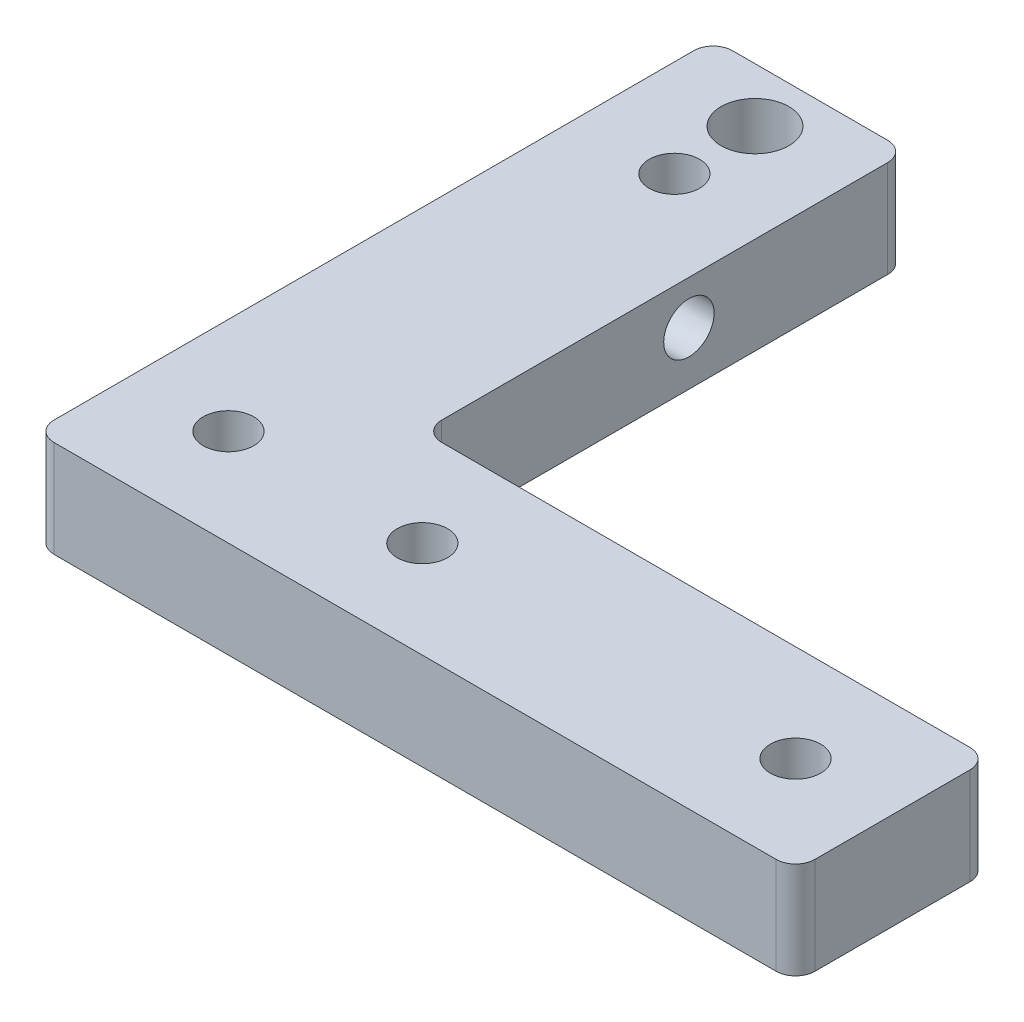
ISO-10303-21;
HEADER;
FILE_DESCRIPTION(('STEP AP214'),'2;1');
FILE_NAME('part.step','',(''),(''),'','','');
FILE_SCHEMA(('AUTOMOTIVE_DESIGN { 1 0 10303 214 1 1 1 1 }'));
ENDSEC;
DATA;
#1=APPLICATION_CONTEXT('core data for automotive mechanical design processes');
#2=APPLICATION_PROTOCOL_DEFINITION('international standard','automotive_design',2000,#1);
#3=PRODUCT_CONTEXT('',#1,'mechanical');
#4=PRODUCT('Part','Part','',(#3));
#5=PRODUCT_RELATED_PRODUCT_CATEGORY('part','',(#4));
#6=PRODUCT_DEFINITION_FORMATION('','',#4);
#7=PRODUCT_DEFINITION_CONTEXT('part definition',#1,'design');
#8=PRODUCT_DEFINITION('design','',#6,#7);
#9=PRODUCT_DEFINITION_SHAPE('','',#8);
#10=(LENGTH_UNIT() NAMED_UNIT(*) SI_UNIT(.MILLI.,.METRE.));
#11=(NAMED_UNIT(*) PLANE_ANGLE_UNIT() SI_UNIT($,.RADIAN.));
#12=(NAMED_UNIT(*) SI_UNIT($,.STERADIAN.) SOLID_ANGLE_UNIT());
#13=UNCERTAINTY_MEASURE_WITH_UNIT(LENGTH_MEASURE(1.E-05),#10,'distance_accuracy_value','');
#14=(GEOMETRIC_REPRESENTATION_CONTEXT(3) GLOBAL_UNCERTAINTY_ASSIGNED_CONTEXT((#13)) GLOBAL_UNIT_ASSIGNED_CONTEXT((#10,
#11,#12)) REPRESENTATION_CONTEXT('',''));
#15=CARTESIAN_POINT('',(0.,0.,0.));
#16=DIRECTION('',(0.,0.,1.));
#17=DIRECTION('',(1.,0.,0.));
#18=AXIS2_PLACEMENT_3D('',#15,#16,#17);
#19=CARTESIAN_POINT('',(9.89945477,5.,-64.41665231));
#20=DIRECTION('',(0.,1.,0.));
#21=DIRECTION('',(-1.,0.,0.));
#22=AXIS2_PLACEMENT_3D('',#19,#20,#21);
#23=PLANE('',#22);
#24=CARTESIAN_POINT('',(9.89945477,5.,-64.41665231));
#25=DIRECTION('',(0.,1.,0.));
#26=DIRECTION('',(-1.,0.,0.));
#27=AXIS2_PLACEMENT_3D('',#24,#25,#26);
#28=CIRCLE('',#27,3.5);
#29=CARTESIAN_POINT('',(6.39945476999999,5.,-64.41665231));
#30=VERTEX_POINT('',#29);
#31=EDGE_CURVE('E19',#30,#30,#28,.T.);
#32=ORIENTED_EDGE('',*,*,#31,.T.);
#33=EDGE_LOOP('',(#32));
#34=FACE_BOUND('',#33,.T.);
#35=ADVANCED_FACE('F16',(#34),#23,.T.);
#36=CARTESIAN_POINT('',(9.89945477,5.,-64.41665231));
#37=DIRECTION('',(0.,1.,0.));
#38=DIRECTION('',(-1.,0.,0.));
#39=AXIS2_PLACEMENT_3D('',#36,#37,#38);
#40=CYLINDRICAL_SURFACE('',#39,3.5);
#41=CARTESIAN_POINT('',(9.89945477,10.,-64.41665231));
#42=DIRECTION('',(0.,1.,0.));
#43=DIRECTION('',(-1.,0.,0.));
#44=AXIS2_PLACEMENT_3D('',#41,#42,#43);
#45=CIRCLE('',#44,3.5);
#46=CARTESIAN_POINT('',(6.39945476999999,10.,-64.41665231));
#47=VERTEX_POINT('',#46);
#48=EDGE_CURVE('E140',#47,#47,#45,.F.);
#49=ORIENTED_EDGE('',*,*,#48,.F.);
#50=EDGE_LOOP('',(#49));
#51=FACE_BOUND('',#50,.T.);
#52=ORIENTED_EDGE('',*,*,#31,.F.);
#53=EDGE_LOOP('',(#52));
#54=FACE_BOUND('',#53,.T.);
#55=ADVANCED_FACE('F268',(#51,#54),#40,.F.);
#56=CARTESIAN_POINT('',(78.5,5.49999999999994,-47.5));
#57=DIRECTION('',(-1.,0.,0.));
#58=DIRECTION('',(0.,-1.,0.));
#59=AXIS2_PLACEMENT_3D('',#56,#57,#58);
#60=CYLINDRICAL_SURFACE('',#59,2.6);
#61=CARTESIAN_POINT('',(20.,5.49999999999995,-47.5));
#62=DIRECTION('',(-1.,0.,0.));
#63=DIRECTION('',(0.,-1.,0.));
#64=AXIS2_PLACEMENT_3D('',#61,#62,#63);
#65=CIRCLE('',#64,2.6);
#66=CARTESIAN_POINT('',(20.,2.89999999999995,-47.5));
#67=VERTEX_POINT('',#66);
#68=EDGE_CURVE('E254',#67,#67,#65,.F.);
#69=ORIENTED_EDGE('',*,*,#68,.T.);
#70=EDGE_LOOP('',(#69));
#71=FACE_BOUND('',#70,.T.);
#72=CARTESIAN_POINT('',(12.0000000000005,5.49999999999995,-47.5));
#73=DIRECTION('',(-1.,0.,0.));
#74=DIRECTION('',(0.,0.,1.));
#75=AXIS2_PLACEMENT_3D('',#72,#73,#74);
#76=CIRCLE('',#75,2.60000000000161);
#77=CARTESIAN_POINT('',(12.0000000000005,5.49999999999995,-44.8999999999984));
#78=VERTEX_POINT('',#77);
#79=EDGE_CURVE('E185',#78,#78,#76,.T.);
#80=ORIENTED_EDGE('',*,*,#79,.T.);
#81=EDGE_LOOP('',(#80));
#82=FACE_BOUND('',#81,.T.);
#83=ADVANCED_FACE('F271',(#71,#82),#60,.F.);
#84=CARTESIAN_POINT('',(1.70530098671652E-10,5.49999999999995,-47.5));
#85=DIRECTION('',(-1.,0.,0.));
#86=DIRECTION('',(0.,0.,1.));
#87=AXIS2_PLACEMENT_3D('',#84,#85,#86);
#88=CONICAL_SURFACE('',#87,3.6498639623025,0.087266462600045);
#89=CARTESIAN_POINT('',(0.,5.49999999999995,-47.5));
#90=DIRECTION('',(-1.,0.,0.));
#91=DIRECTION('',(0.,0.,1.));
#92=AXIS2_PLACEMENT_3D('',#89,#90,#91);
#93=CIRCLE('',#92,3.64986396231742);
#94=CARTESIAN_POINT('',(0.,5.49999999999995,-43.8501360376826));
#95=VERTEX_POINT('',#94);
#96=EDGE_CURVE('E245',#95,#95,#93,.T.);
#97=ORIENTED_EDGE('',*,*,#96,.T.);
#98=EDGE_LOOP('',(#97));
#99=FACE_BOUND('',#98,.T.);
#100=ORIENTED_EDGE('',*,*,#79,.F.);
#101=EDGE_LOOP('',(#100));
#102=FACE_BOUND('',#101,.T.);
#103=ADVANCED_FACE('F351',(#99,#102),#88,.F.);
#104=CARTESIAN_POINT('',(0.,10.,0.));
#105=DIRECTION('',(0.,1.,0.));
#106=DIRECTION('',(-1.,0.,0.));
#107=AXIS2_PLACEMENT_3D('',#104,#105,#106);
#108=PLANE('',#107);
#109=CARTESIAN_POINT('',(30.,10.,-10.));
#110=DIRECTION('',(0.,-1.,0.));
#111=DIRECTION('',(1.,0.,0.));
#112=AXIS2_PLACEMENT_3D('',#109,#110,#111);
#113=CIRCLE('',#112,2.59999999999999);
#114=CARTESIAN_POINT('',(32.6,10.,-10.));
#115=VERTEX_POINT('',#114);
#116=EDGE_CURVE('E227',#115,#115,#113,.T.);
#117=ORIENTED_EDGE('',*,*,#116,.T.);
#118=EDGE_LOOP('',(#117));
#119=FACE_BOUND('',#118,.T.);
#120=CARTESIAN_POINT('',(68.5,10.,-9.99999999999999));
#121=DIRECTION('',(0.,-1.,0.));
#122=DIRECTION('',(1.,0.,0.));
#123=AXIS2_PLACEMENT_3D('',#120,#121,#122);
#124=CIRCLE('',#123,2.59999999999999);
#125=CARTESIAN_POINT('',(71.1,10.,-9.99999999999999));
#126=VERTEX_POINT('',#125);
#127=EDGE_CURVE('E235',#126,#126,#124,.T.);
#128=ORIENTED_EDGE('',*,*,#127,.T.);
#129=EDGE_LOOP('',(#128));
#130=FACE_BOUND('',#129,.T.);
#131=DIRECTION('',(1.,0.,0.));
#132=VECTOR('',#131,1.);
#133=CARTESIAN_POINT('',(20.,10.,-70.));
#134=LINE('',#133,#132);
#135=CARTESIAN_POINT('',(18.,10.,-70.));
#136=VERTEX_POINT('',#135);
#137=CARTESIAN_POINT('',(2.,10.,-70.));
#138=VERTEX_POINT('',#137);
#139=EDGE_CURVE('E169',#136,#138,#134,.F.);
#140=ORIENTED_EDGE('',*,*,#139,.T.);
#141=CARTESIAN_POINT('',(2.,10.,-68.));
#142=DIRECTION('',(0.,-1.,0.));
#143=DIRECTION('',(1.,0.,0.));
#144=AXIS2_PLACEMENT_3D('',#141,#142,#143);
#145=CIRCLE('',#144,2.);
#146=CARTESIAN_POINT('',(0.,10.,-68.));
#147=VERTEX_POINT('',#146);
#148=EDGE_CURVE('E172',#147,#138,#145,.T.);
#149=ORIENTED_EDGE('',*,*,#148,.F.);
#150=DIRECTION('',(0.,0.,1.));
#151=VECTOR('',#150,1.);
#152=CARTESIAN_POINT('',(0.,10.,-70.));
#153=LINE('',#152,#151);
#154=CARTESIAN_POINT('',(0.,10.,-2.));
#155=VERTEX_POINT('',#154);
#156=EDGE_CURVE('E163',#147,#155,#153,.T.);
#157=ORIENTED_EDGE('',*,*,#156,.T.);
#158=CARTESIAN_POINT('',(2.,10.,-2.));
#159=DIRECTION('',(0.,-1.,0.));
#160=DIRECTION('',(1.,0.,0.));
#161=AXIS2_PLACEMENT_3D('',#158,#159,#160);
#162=CIRCLE('',#161,2.);
#163=CARTESIAN_POINT('',(2.,10.,0.));
#164=VERTEX_POINT('',#163);
#165=EDGE_CURVE('E167',#164,#155,#162,.T.);
#166=ORIENTED_EDGE('',*,*,#165,.F.);
#167=DIRECTION('',(1.,0.,0.));
#168=VECTOR('',#167,1.);
#169=CARTESIAN_POINT('',(0.,10.,0.));
#170=LINE('',#169,#168);
#171=CARTESIAN_POINT('',(76.5,10.,0.));
#172=VERTEX_POINT('',#171);
#173=EDGE_CURVE('E133',#164,#172,#170,.T.);
#174=ORIENTED_EDGE('',*,*,#173,.T.);
#175=CARTESIAN_POINT('',(76.5,10.,-2.));
#176=DIRECTION('',(0.,-1.,0.));
#177=DIRECTION('',(1.,0.,0.));
#178=AXIS2_PLACEMENT_3D('',#175,#176,#177);
#179=CIRCLE('',#178,2.);
#180=CARTESIAN_POINT('',(78.5,10.,-2.));
#181=VERTEX_POINT('',#180);
#182=EDGE_CURVE('E126',#181,#172,#179,.T.);
#183=ORIENTED_EDGE('',*,*,#182,.F.);
#184=DIRECTION('',(0.,0.,1.));
#185=VECTOR('',#184,1.);
#186=CARTESIAN_POINT('',(78.5,10.,0.));
#187=LINE('',#186,#185);
#188=CARTESIAN_POINT('',(78.5,10.,-18.));
#189=VERTEX_POINT('',#188);
#190=EDGE_CURVE('E131',#181,#189,#187,.F.);
#191=ORIENTED_EDGE('',*,*,#190,.T.);
#192=CARTESIAN_POINT('',(76.5,10.,-18.));
#193=DIRECTION('',(0.,-1.,0.));
#194=DIRECTION('',(1.,0.,0.));
#195=AXIS2_PLACEMENT_3D('',#192,#193,#194);
#196=CIRCLE('',#195,2.);
#197=CARTESIAN_POINT('',(76.5,10.,-20.));
#198=VERTEX_POINT('',#197);
#199=EDGE_CURVE('E148',#198,#189,#196,.T.);
#200=ORIENTED_EDGE('',*,*,#199,.F.);
#201=DIRECTION('',(1.,0.,0.));
#202=VECTOR('',#201,1.);
#203=CARTESIAN_POINT('',(78.5,10.,-20.));
#204=LINE('',#203,#202);
#205=CARTESIAN_POINT('',(22.,10.,-20.));
#206=VERTEX_POINT('',#205);
#207=EDGE_CURVE('E180',#198,#206,#204,.F.);
#208=ORIENTED_EDGE('',*,*,#207,.T.);
#209=CARTESIAN_POINT('',(22.,10.,-22.));
#210=DIRECTION('',(0.,1.,0.));
#211=DIRECTION('',(-1.,0.,0.));
#212=AXIS2_PLACEMENT_3D('',#209,#210,#211);
#213=CIRCLE('',#212,2.);
#214=CARTESIAN_POINT('',(20.,10.,-22.));
#215=VERTEX_POINT('',#214);
#216=EDGE_CURVE('E258',#206,#215,#213,.F.);
#217=ORIENTED_EDGE('',*,*,#216,.T.);
#218=DIRECTION('',(0.,0.,1.));
#219=VECTOR('',#218,1.);
#220=CARTESIAN_POINT('',(20.,10.,-20.));
#221=LINE('',#220,#219);
#222=CARTESIAN_POINT('',(20.,10.,-68.));
#223=VERTEX_POINT('',#222);
#224=EDGE_CURVE('E174',#215,#223,#221,.F.);
#225=ORIENTED_EDGE('',*,*,#224,.T.);
#226=CARTESIAN_POINT('',(18.,10.,-68.));
#227=DIRECTION('',(0.,-1.,0.));
#228=DIRECTION('',(1.,0.,0.));
#229=AXIS2_PLACEMENT_3D('',#226,#227,#228);
#230=CIRCLE('',#229,2.);
#231=EDGE_CURVE('E178',#136,#223,#230,.T.);
#232=ORIENTED_EDGE('',*,*,#231,.F.);
#233=EDGE_LOOP('',(#140,#149,#157,#166,#174,#183,#191,#200,#208,#217,#225,#232));
#234=FACE_BOUND('',#233,.T.);
#235=CARTESIAN_POINT('',(10.,10.,-56.));
#236=DIRECTION('',(0.,-1.,0.));
#237=DIRECTION('',(1.,0.,0.));
#238=AXIS2_PLACEMENT_3D('',#235,#236,#237);
#239=CIRCLE('',#238,2.6);
#240=CARTESIAN_POINT('',(12.6,10.,-56.));
#241=VERTEX_POINT('',#240);
#242=EDGE_CURVE('E162',#241,#241,#239,.T.);
#243=ORIENTED_EDGE('',*,*,#242,.T.);
#244=EDGE_LOOP('',(#243));
#245=FACE_BOUND('',#244,.T.);
#246=CARTESIAN_POINT('',(10.,10.,-10.));
#247=DIRECTION('',(0.,-1.,0.));
#248=DIRECTION('',(1.,0.,0.));
#249=AXIS2_PLACEMENT_3D('',#246,#247,#248);
#250=CIRCLE('',#249,2.6);
#251=CARTESIAN_POINT('',(12.6,10.,-10.));
#252=VERTEX_POINT('',#251);
#253=EDGE_CURVE('E231',#252,#252,#250,.T.);
#254=ORIENTED_EDGE('',*,*,#253,.T.);
#255=EDGE_LOOP('',(#254));
#256=FACE_BOUND('',#255,.T.);
#257=ORIENTED_EDGE('',*,*,#48,.T.);
#258=EDGE_LOOP('',(#257));
#259=FACE_BOUND('',#258,.T.);
#260=ADVANCED_FACE('F129',(#119,#130,#234,#245,#256,#259),#108,.T.);
#261=CARTESIAN_POINT('',(76.5,10.,-2.));
#262=DIRECTION('',(0.,-1.,0.));
#263=DIRECTION('',(1.,0.,0.));
#264=AXIS2_PLACEMENT_3D('',#261,#262,#263);
#265=CYLINDRICAL_SURFACE('',#264,2.);
#266=CARTESIAN_POINT('',(76.5,0.,-2.));
#267=DIRECTION('',(0.,-1.,0.));
#268=DIRECTION('',(1.,0.,0.));
#269=AXIS2_PLACEMENT_3D('',#266,#267,#268);
#270=CIRCLE('',#269,2.);
#271=CARTESIAN_POINT('',(76.5,0.,0.));
#272=VERTEX_POINT('',#271);
#273=CARTESIAN_POINT('',(78.5,0.,-2.));
#274=VERTEX_POINT('',#273);
#275=EDGE_CURVE('E152',#272,#274,#270,.F.);
#276=ORIENTED_EDGE('',*,*,#275,.T.);
#277=DIRECTION('',(0.,-1.,0.));
#278=VECTOR('',#277,1.);
#279=CARTESIAN_POINT('',(78.5,10.,-2.));
#280=LINE('',#279,#278);
#281=EDGE_CURVE('E139',#274,#181,#280,.F.);
#282=ORIENTED_EDGE('',*,*,#281,.T.);
#283=ORIENTED_EDGE('',*,*,#182,.T.);
#284=DIRECTION('',(0.,1.,0.));
#285=VECTOR('',#284,1.);
#286=CARTESIAN_POINT('',(76.5,10.,0.));
#287=LINE('',#286,#285);
#288=EDGE_CURVE('E530',#172,#272,#287,.F.);
#289=ORIENTED_EDGE('',*,*,#288,.T.);
#290=EDGE_LOOP('',(#276,#282,#283,#289));
#291=FACE_BOUND('',#290,.T.);
#292=ADVANCED_FACE('F151',(#291),#265,.T.);
#293=CARTESIAN_POINT('',(78.5,10.,0.));
#294=DIRECTION('',(-1.,0.,0.));
#295=DIRECTION('',(0.,-1.,0.));
#296=AXIS2_PLACEMENT_3D('',#293,#294,#295);
#297=PLANE('',#296);
#298=ORIENTED_EDGE('',*,*,#281,.F.);
#299=DIRECTION('',(0.,0.,1.));
#300=VECTOR('',#299,1.);
#301=CARTESIAN_POINT('',(78.5,0.,0.));
#302=LINE('',#301,#300);
#303=CARTESIAN_POINT('',(78.5,0.,-18.));
#304=VERTEX_POINT('',#303);
#305=EDGE_CURVE('E224',#274,#304,#302,.F.);
#306=ORIENTED_EDGE('',*,*,#305,.T.);
#307=DIRECTION('',(0.,-1.,0.));
#308=VECTOR('',#307,1.);
#309=CARTESIAN_POINT('',(78.5,10.,-18.));
#310=LINE('',#309,#308);
#311=EDGE_CURVE('E146',#189,#304,#310,.T.);
#312=ORIENTED_EDGE('',*,*,#311,.F.);
#313=ORIENTED_EDGE('',*,*,#190,.F.);
#314=EDGE_LOOP('',(#298,#306,#312,#313));
#315=FACE_BOUND('',#314,.T.);
#316=ADVANCED_FACE('F143',(#315),#297,.F.);
#317=CARTESIAN_POINT('',(76.5,10.,-18.));
#318=DIRECTION('',(0.,-1.,0.));
#319=DIRECTION('',(1.,0.,0.));
#320=AXIS2_PLACEMENT_3D('',#317,#318,#319);
#321=CYLINDRICAL_SURFACE('',#320,2.);
#322=CARTESIAN_POINT('',(76.5,0.,-18.));
#323=DIRECTION('',(0.,-1.,0.));
#324=DIRECTION('',(1.,0.,0.));
#325=AXIS2_PLACEMENT_3D('',#322,#323,#324);
#326=CIRCLE('',#325,2.);
#327=CARTESIAN_POINT('',(76.5,0.,-20.));
#328=VERTEX_POINT('',#327);
#329=EDGE_CURVE('E220',#304,#328,#326,.F.);
#330=ORIENTED_EDGE('',*,*,#329,.T.);
#331=DIRECTION('',(0.,1.,0.));
#332=VECTOR('',#331,1.);
#333=CARTESIAN_POINT('',(76.5,10.,-20.));
#334=LINE('',#333,#332);
#335=EDGE_CURVE('E183',#328,#198,#334,.T.);
#336=ORIENTED_EDGE('',*,*,#335,.T.);
#337=ORIENTED_EDGE('',*,*,#199,.T.);
#338=ORIENTED_EDGE('',*,*,#311,.T.);
#339=EDGE_LOOP('',(#330,#336,#337,#338));
#340=FACE_BOUND('',#339,.T.);
#341=ADVANCED_FACE('F340',(#340),#321,.T.);
#342=CARTESIAN_POINT('',(78.5,10.,-20.));
#343=DIRECTION('',(0.,0.,1.));
#344=DIRECTION('',(1.,0.,0.));
#345=AXIS2_PLACEMENT_3D('',#342,#343,#344);
#346=PLANE('',#345);
#347=DIRECTION('',(0.,1.,0.));
#348=VECTOR('',#347,1.);
#349=CARTESIAN_POINT('',(22.,10.,-20.));
#350=LINE('',#349,#348);
#351=CARTESIAN_POINT('',(22.,0.,-20.));
#352=VERTEX_POINT('',#351);
#353=EDGE_CURVE('E182',#352,#206,#350,.T.);
#354=ORIENTED_EDGE('',*,*,#353,.T.);
#355=ORIENTED_EDGE('',*,*,#207,.F.);
#356=ORIENTED_EDGE('',*,*,#335,.F.);
#357=DIRECTION('',(-1.,0.,0.));
#358=VECTOR('',#357,1.);
#359=CARTESIAN_POINT('',(0.,0.,-20.));
#360=LINE('',#359,#358);
#361=EDGE_CURVE('E219',#328,#352,#360,.T.);
#362=ORIENTED_EDGE('',*,*,#361,.T.);
#363=EDGE_LOOP('',(#354,#355,#356,#362));
#364=FACE_BOUND('',#363,.T.);
#365=ADVANCED_FACE('F336',(#364),#346,.F.);
#366=CARTESIAN_POINT('',(22.,10.,-22.));
#367=DIRECTION('',(0.,1.,0.));
#368=DIRECTION('',(-1.,0.,0.));
#369=AXIS2_PLACEMENT_3D('',#366,#367,#368);
#370=CYLINDRICAL_SURFACE('',#369,2.);
#371=ORIENTED_EDGE('',*,*,#353,.F.);
#372=CARTESIAN_POINT('',(22.,0.,-22.));
#373=DIRECTION('',(0.,1.,0.));
#374=DIRECTION('',(-1.,0.,0.));
#375=AXIS2_PLACEMENT_3D('',#372,#373,#374);
#376=CIRCLE('',#375,2.);
#377=CARTESIAN_POINT('',(20.,0.,-22.));
#378=VERTEX_POINT('',#377);
#379=EDGE_CURVE('E215',#352,#378,#376,.F.);
#380=ORIENTED_EDGE('',*,*,#379,.T.);
#381=DIRECTION('',(0.,1.,0.));
#382=VECTOR('',#381,1.);
#383=CARTESIAN_POINT('',(20.,10.,-22.));
#384=LINE('',#383,#382);
#385=EDGE_CURVE('E179',#378,#215,#384,.T.);
#386=ORIENTED_EDGE('',*,*,#385,.T.);
#387=ORIENTED_EDGE('',*,*,#216,.F.);
#388=EDGE_LOOP('',(#371,#380,#386,#387));
#389=FACE_BOUND('',#388,.T.);
#390=ADVANCED_FACE('F332',(#389),#370,.F.);
#391=CARTESIAN_POINT('',(20.,10.,-20.));
#392=DIRECTION('',(-1.,0.,0.));
#393=DIRECTION('',(0.,0.,1.));
#394=AXIS2_PLACEMENT_3D('',#391,#392,#393);
#395=PLANE('',#394);
#396=DIRECTION('',(0.,-1.,0.));
#397=VECTOR('',#396,1.);
#398=CARTESIAN_POINT('',(20.,10.,-68.));
#399=LINE('',#398,#397);
#400=CARTESIAN_POINT('',(20.,0.,-68.));
#401=VERTEX_POINT('',#400);
#402=EDGE_CURVE('E253',#223,#401,#399,.T.);
#403=ORIENTED_EDGE('',*,*,#402,.F.);
#404=ORIENTED_EDGE('',*,*,#224,.F.);
#405=ORIENTED_EDGE('',*,*,#385,.F.);
#406=DIRECTION('',(0.,0.,1.));
#407=VECTOR('',#406,1.);
#408=CARTESIAN_POINT('',(20.,0.,0.));
#409=LINE('',#408,#407);
#410=EDGE_CURVE('E214',#378,#401,#409,.F.);
#411=ORIENTED_EDGE('',*,*,#410,.T.);
#412=EDGE_LOOP('',(#403,#404,#405,#411));
#413=FACE_BOUND('',#412,.T.);
#414=ORIENTED_EDGE('',*,*,#68,.F.);
#415=EDGE_LOOP('',(#414));
#416=FACE_BOUND('',#415,.T.);
#417=ADVANCED_FACE('F328',(#413,#416),#395,.F.);
#418=CARTESIAN_POINT('',(18.,10.,-68.));
#419=DIRECTION('',(0.,-1.,0.));
#420=DIRECTION('',(1.,0.,0.));
#421=AXIS2_PLACEMENT_3D('',#418,#419,#420);
#422=CYLINDRICAL_SURFACE('',#421,2.);
#423=CARTESIAN_POINT('',(18.,0.,-68.));
#424=DIRECTION('',(0.,-1.,0.));
#425=DIRECTION('',(1.,0.,0.));
#426=AXIS2_PLACEMENT_3D('',#423,#424,#425);
#427=CIRCLE('',#426,2.);
#428=CARTESIAN_POINT('',(18.,0.,-70.));
#429=VERTEX_POINT('',#428);
#430=EDGE_CURVE('E210',#401,#429,#427,.F.);
#431=ORIENTED_EDGE('',*,*,#430,.T.);
#432=DIRECTION('',(0.,-1.,0.));
#433=VECTOR('',#432,1.);
#434=CARTESIAN_POINT('',(18.,10.,-70.));
#435=LINE('',#434,#433);
#436=EDGE_CURVE('E173',#429,#136,#435,.F.);
#437=ORIENTED_EDGE('',*,*,#436,.T.);
#438=ORIENTED_EDGE('',*,*,#231,.T.);
#439=ORIENTED_EDGE('',*,*,#402,.T.);
#440=EDGE_LOOP('',(#431,#437,#438,#439));
#441=FACE_BOUND('',#440,.T.);
#442=ADVANCED_FACE('F324',(#441),#422,.T.);
#443=CARTESIAN_POINT('',(20.,10.,-70.));
#444=DIRECTION('',(0.,0.,1.));
#445=DIRECTION('',(0.,-1.,0.));
#446=AXIS2_PLACEMENT_3D('',#443,#444,#445);
#447=PLANE('',#446);
#448=DIRECTION('',(0.,-1.,0.));
#449=VECTOR('',#448,1.);
#450=CARTESIAN_POINT('',(1.99999999999999,10.,-70.));
#451=LINE('',#450,#449);
#452=CARTESIAN_POINT('',(2.,0.,-70.));
#453=VERTEX_POINT('',#452);
#454=EDGE_CURVE('E249',#138,#453,#451,.T.);
#455=ORIENTED_EDGE('',*,*,#454,.F.);
#456=ORIENTED_EDGE('',*,*,#139,.F.);
#457=ORIENTED_EDGE('',*,*,#436,.F.);
#458=DIRECTION('',(-1.,0.,0.));
#459=VECTOR('',#458,1.);
#460=CARTESIAN_POINT('',(0.,0.,-70.));
#461=LINE('',#460,#459);
#462=EDGE_CURVE('E209',#429,#453,#461,.T.);
#463=ORIENTED_EDGE('',*,*,#462,.T.);
#464=EDGE_LOOP('',(#455,#456,#457,#463));
#465=FACE_BOUND('',#464,.T.);
#466=ADVANCED_FACE('F320',(#465),#447,.F.);
#467=CARTESIAN_POINT('',(2.,10.,-68.));
#468=DIRECTION('',(0.,-1.,0.));
#469=DIRECTION('',(1.,0.,0.));
#470=AXIS2_PLACEMENT_3D('',#467,#468,#469);
#471=CYLINDRICAL_SURFACE('',#470,2.);
#472=CARTESIAN_POINT('',(2.,0.,-68.));
#473=DIRECTION('',(0.,-1.,0.));
#474=DIRECTION('',(1.,0.,0.));
#475=AXIS2_PLACEMENT_3D('',#472,#473,#474);
#476=CIRCLE('',#475,2.);
#477=CARTESIAN_POINT('',(0.,0.,-68.));
#478=VERTEX_POINT('',#477);
#479=EDGE_CURVE('E206',#453,#478,#476,.F.);
#480=ORIENTED_EDGE('',*,*,#479,.T.);
#481=DIRECTION('',(0.,1.,0.));
#482=VECTOR('',#481,1.);
#483=CARTESIAN_POINT('',(0.,10.,-68.));
#484=LINE('',#483,#482);
#485=EDGE_CURVE('E168',#478,#147,#484,.T.);
#486=ORIENTED_EDGE('',*,*,#485,.T.);
#487=ORIENTED_EDGE('',*,*,#148,.T.);
#488=ORIENTED_EDGE('',*,*,#454,.T.);
#489=EDGE_LOOP('',(#480,#486,#487,#488));
#490=FACE_BOUND('',#489,.T.);
#491=ADVANCED_FACE('F316',(#490),#471,.T.);
#492=CARTESIAN_POINT('',(0.,10.,-70.));
#493=DIRECTION('',(1.,0.,0.));
#494=DIRECTION('',(0.,1.,0.));
#495=AXIS2_PLACEMENT_3D('',#492,#493,#494);
#496=PLANE('',#495);
#497=DIRECTION('',(0.,-1.,0.));
#498=VECTOR('',#497,1.);
#499=CARTESIAN_POINT('',(0.,10.,-2.));
#500=LINE('',#499,#498);
#501=CARTESIAN_POINT('',(0.,0.,-2.));
#502=VERTEX_POINT('',#501);
#503=EDGE_CURVE('E244',#155,#502,#500,.T.);
#504=ORIENTED_EDGE('',*,*,#503,.F.);
#505=ORIENTED_EDGE('',*,*,#156,.F.);
#506=ORIENTED_EDGE('',*,*,#485,.F.);
#507=DIRECTION('',(0.,0.,1.));
#508=VECTOR('',#507,1.);
#509=CARTESIAN_POINT('',(0.,0.,0.));
#510=LINE('',#509,#508);
#511=EDGE_CURVE('E205',#478,#502,#510,.T.);
#512=ORIENTED_EDGE('',*,*,#511,.T.);
#513=EDGE_LOOP('',(#504,#505,#506,#512));
#514=FACE_BOUND('',#513,.T.);
#515=ORIENTED_EDGE('',*,*,#96,.F.);
#516=EDGE_LOOP('',(#515));
#517=FACE_BOUND('',#516,.T.);
#518=ADVANCED_FACE('F312',(#514,#517),#496,.F.);
#519=CARTESIAN_POINT('',(2.,10.,-2.));
#520=DIRECTION('',(0.,-1.,0.));
#521=DIRECTION('',(1.,0.,0.));
#522=AXIS2_PLACEMENT_3D('',#519,#520,#521);
#523=CYLINDRICAL_SURFACE('',#522,2.);
#524=CARTESIAN_POINT('',(2.,0.,-2.));
#525=DIRECTION('',(0.,-1.,0.));
#526=DIRECTION('',(1.,0.,0.));
#527=AXIS2_PLACEMENT_3D('',#524,#525,#526);
#528=CIRCLE('',#527,2.);
#529=CARTESIAN_POINT('',(2.,0.,0.));
#530=VERTEX_POINT('',#529);
#531=EDGE_CURVE('E201',#502,#530,#528,.F.);
#532=ORIENTED_EDGE('',*,*,#531,.T.);
#533=DIRECTION('',(0.,1.,0.));
#534=VECTOR('',#533,1.);
#535=CARTESIAN_POINT('',(2.,10.,0.));
#536=LINE('',#535,#534);
#537=EDGE_CURVE('E39',#530,#164,#536,.T.);
#538=ORIENTED_EDGE('',*,*,#537,.T.);
#539=ORIENTED_EDGE('',*,*,#165,.T.);
#540=ORIENTED_EDGE('',*,*,#503,.T.);
#541=EDGE_LOOP('',(#532,#538,#539,#540));
#542=FACE_BOUND('',#541,.T.);
#543=ADVANCED_FACE('F309',(#542),#523,.T.);
#544=CARTESIAN_POINT('',(0.,10.,0.));
#545=DIRECTION('',(0.,0.,-1.));
#546=DIRECTION('',(0.,1.,0.));
#547=AXIS2_PLACEMENT_3D('',#544,#545,#546);
#548=PLANE('',#547);
#549=ORIENTED_EDGE('',*,*,#537,.F.);
#550=DIRECTION('',(-1.,0.,0.));
#551=VECTOR('',#550,1.);
#552=CARTESIAN_POINT('',(0.,0.,0.));
#553=LINE('',#552,#551);
#554=EDGE_CURVE('E200',#530,#272,#553,.F.);
#555=ORIENTED_EDGE('',*,*,#554,.T.);
#556=ORIENTED_EDGE('',*,*,#288,.F.);
#557=ORIENTED_EDGE('',*,*,#173,.F.);
#558=EDGE_LOOP('',(#549,#555,#556,#557));
#559=FACE_BOUND('',#558,.T.);
#560=ADVANCED_FACE('F305',(#559),#548,.F.);
#561=CARTESIAN_POINT('',(10.,10.,-56.));
#562=DIRECTION('',(0.,-1.,0.));
#563=DIRECTION('',(1.,0.,0.));
#564=AXIS2_PLACEMENT_3D('',#561,#562,#563);
#565=CYLINDRICAL_SURFACE('',#564,2.6);
#566=CARTESIAN_POINT('',(10.,0.,-56.));
#567=DIRECTION('',(0.,-1.,0.));
#568=DIRECTION('',(1.,0.,0.));
#569=AXIS2_PLACEMENT_3D('',#566,#567,#568);
#570=CIRCLE('',#569,2.6);
#571=CARTESIAN_POINT('',(12.6,0.,-56.));
#572=VERTEX_POINT('',#571);
#573=EDGE_CURVE('E196',#572,#572,#570,.T.);
#574=ORIENTED_EDGE('',*,*,#573,.T.);
#575=EDGE_LOOP('',(#574));
#576=FACE_BOUND('',#575,.T.);
#577=ORIENTED_EDGE('',*,*,#242,.F.);
#578=EDGE_LOOP('',(#577));
#579=FACE_BOUND('',#578,.T.);
#580=ADVANCED_FACE('F301',(#576,#579),#565,.F.);
#581=CARTESIAN_POINT('',(68.5,10.,-9.99999999999999));
#582=DIRECTION('',(0.,-1.,0.));
#583=DIRECTION('',(1.,0.,0.));
#584=AXIS2_PLACEMENT_3D('',#581,#582,#583);
#585=CYLINDRICAL_SURFACE('',#584,2.59999999999999);
#586=CARTESIAN_POINT('',(68.5,0.,-9.99999999999999));
#587=DIRECTION('',(0.,-1.,0.));
#588=DIRECTION('',(1.,0.,0.));
#589=AXIS2_PLACEMENT_3D('',#586,#587,#588);
#590=CIRCLE('',#589,2.59999999999999);
#591=CARTESIAN_POINT('',(71.1,0.,-9.99999999999999));
#592=VERTEX_POINT('',#591);
#593=EDGE_CURVE('E192',#592,#592,#590,.T.);
#594=ORIENTED_EDGE('',*,*,#593,.T.);
#595=EDGE_LOOP('',(#594));
#596=FACE_BOUND('',#595,.T.);
#597=ORIENTED_EDGE('',*,*,#127,.F.);
#598=EDGE_LOOP('',(#597));
#599=FACE_BOUND('',#598,.T.);
#600=ADVANCED_FACE('F298',(#596,#599),#585,.F.);
#601=CARTESIAN_POINT('',(10.,10.,-10.));
#602=DIRECTION('',(0.,-1.,0.));
#603=DIRECTION('',(1.,0.,0.));
#604=AXIS2_PLACEMENT_3D('',#601,#602,#603);
#605=CYLINDRICAL_SURFACE('',#604,2.6);
#606=CARTESIAN_POINT('',(10.,0.,-10.));
#607=DIRECTION('',(0.,-1.,0.));
#608=DIRECTION('',(1.,0.,0.));
#609=AXIS2_PLACEMENT_3D('',#606,#607,#608);
#610=CIRCLE('',#609,2.6);
#611=CARTESIAN_POINT('',(12.6,0.,-10.));
#612=VERTEX_POINT('',#611);
#613=EDGE_CURVE('E26',#612,#612,#610,.T.);
#614=ORIENTED_EDGE('',*,*,#613,.T.);
#615=EDGE_LOOP('',(#614));
#616=FACE_BOUND('',#615,.T.);
#617=ORIENTED_EDGE('',*,*,#253,.F.);
#618=EDGE_LOOP('',(#617));
#619=FACE_BOUND('',#618,.T.);
#620=ADVANCED_FACE('F290',(#616,#619),#605,.F.);
#621=CARTESIAN_POINT('',(30.,10.,-10.));
#622=DIRECTION('',(0.,-1.,0.));
#623=DIRECTION('',(1.,0.,0.));
#624=AXIS2_PLACEMENT_3D('',#621,#622,#623);
#625=CYLINDRICAL_SURFACE('',#624,2.59999999999999);
#626=CARTESIAN_POINT('',(30.,0.,-10.));
#627=DIRECTION('',(0.,-1.,0.));
#628=DIRECTION('',(1.,0.,0.));
#629=AXIS2_PLACEMENT_3D('',#626,#627,#628);
#630=CIRCLE('',#629,2.59999999999999);
#631=CARTESIAN_POINT('',(32.6,0.,-10.));
#632=VERTEX_POINT('',#631);
#633=EDGE_CURVE('E11',#632,#632,#630,.T.);
#634=ORIENTED_EDGE('',*,*,#633,.T.);
#635=EDGE_LOOP('',(#634));
#636=FACE_BOUND('',#635,.T.);
#637=ORIENTED_EDGE('',*,*,#116,.F.);
#638=EDGE_LOOP('',(#637));
#639=FACE_BOUND('',#638,.T.);
#640=ADVANCED_FACE('F283',(#636,#639),#625,.F.);
#641=CARTESIAN_POINT('',(0.,0.,0.));
#642=DIRECTION('',(0.,1.,0.));
#643=DIRECTION('',(-1.,0.,0.));
#644=AXIS2_PLACEMENT_3D('',#641,#642,#643);
#645=PLANE('',#644);
#646=ORIENTED_EDGE('',*,*,#633,.F.);
#647=EDGE_LOOP('',(#646));
#648=FACE_BOUND('',#647,.T.);
#649=ORIENTED_EDGE('',*,*,#613,.F.);
#650=EDGE_LOOP('',(#649));
#651=FACE_BOUND('',#650,.T.);
#652=ORIENTED_EDGE('',*,*,#593,.F.);
#653=EDGE_LOOP('',(#652));
#654=FACE_BOUND('',#653,.T.);
#655=ORIENTED_EDGE('',*,*,#573,.F.);
#656=EDGE_LOOP('',(#655));
#657=FACE_BOUND('',#656,.T.);
#658=ORIENTED_EDGE('',*,*,#531,.F.);
#659=ORIENTED_EDGE('',*,*,#511,.F.);
#660=ORIENTED_EDGE('',*,*,#479,.F.);
#661=ORIENTED_EDGE('',*,*,#462,.F.);
#662=ORIENTED_EDGE('',*,*,#430,.F.);
#663=ORIENTED_EDGE('',*,*,#410,.F.);
#664=ORIENTED_EDGE('',*,*,#379,.F.);
#665=ORIENTED_EDGE('',*,*,#361,.F.);
#666=ORIENTED_EDGE('',*,*,#329,.F.);
#667=ORIENTED_EDGE('',*,*,#305,.F.);
#668=ORIENTED_EDGE('',*,*,#275,.F.);
#669=ORIENTED_EDGE('',*,*,#554,.F.);
#670=EDGE_LOOP('',(#658,#659,#660,#661,#662,#663,#664,#665,#666,#667,#668,#669));
#671=FACE_BOUND('',#670,.T.);
#672=ADVANCED_FACE('F281',(#648,#651,#654,#657,#671),#645,.F.);
#673=CLOSED_SHELL('',(#35,#55,#83,#103,#260,#292,#316,#341,#365,#390,#417,#442,#466,#491,#518,
#543,#560,#580,#600,#620,#640,#672));
#674=MANIFOLD_SOLID_BREP('B1',#673);
#675=ADVANCED_BREP_SHAPE_REPRESENTATION('',(#18,#674),#14);
#676=SHAPE_DEFINITION_REPRESENTATION(#9,#675);
ENDSEC;
END-ISO-10303-21;
